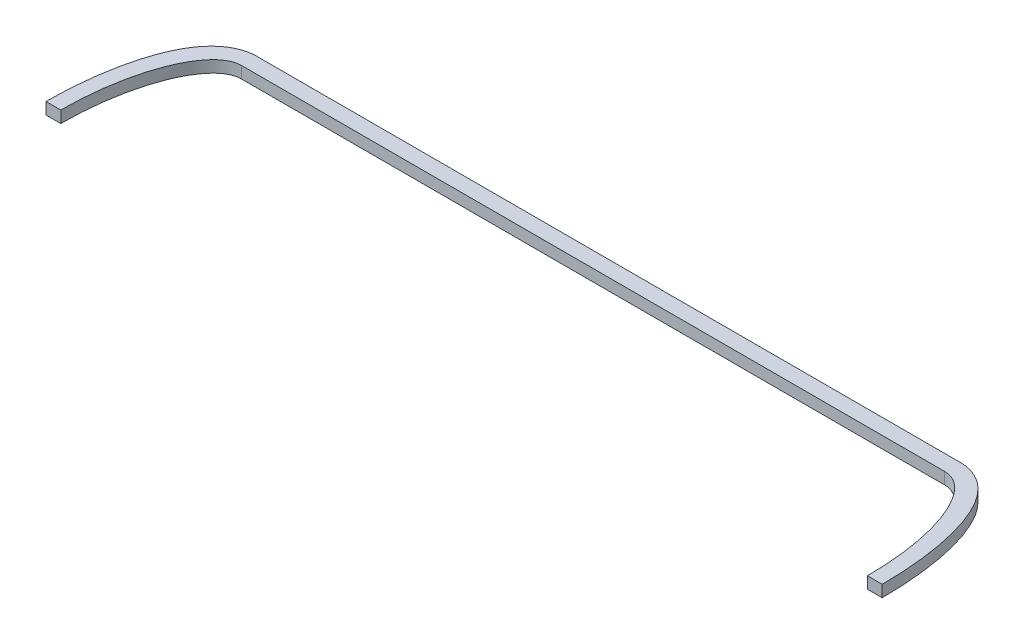
ISO-10303-21;
HEADER;
FILE_DESCRIPTION(('STEP AP214'),'2;1');
FILE_NAME('part.step','',(''),(''),'','','');
FILE_SCHEMA(('AUTOMOTIVE_DESIGN { 1 0 10303 214 1 1 1 1 }'));
ENDSEC;
DATA;
#1=APPLICATION_CONTEXT('core data for automotive mechanical design processes');
#2=APPLICATION_PROTOCOL_DEFINITION('international standard','automotive_design',2000,#1);
#3=PRODUCT_CONTEXT('',#1,'mechanical');
#4=PRODUCT('Part','Part','',(#3));
#5=PRODUCT_RELATED_PRODUCT_CATEGORY('part','',(#4));
#6=PRODUCT_DEFINITION_FORMATION('','',#4);
#7=PRODUCT_DEFINITION_CONTEXT('part definition',#1,'design');
#8=PRODUCT_DEFINITION('design','',#6,#7);
#9=PRODUCT_DEFINITION_SHAPE('','',#8);
#10=(LENGTH_UNIT() NAMED_UNIT(*) SI_UNIT(.MILLI.,.METRE.));
#11=(NAMED_UNIT(*) PLANE_ANGLE_UNIT() SI_UNIT($,.RADIAN.));
#12=(NAMED_UNIT(*) SI_UNIT($,.STERADIAN.) SOLID_ANGLE_UNIT());
#13=UNCERTAINTY_MEASURE_WITH_UNIT(LENGTH_MEASURE(1.E-05),#10,'distance_accuracy_value','');
#14=(GEOMETRIC_REPRESENTATION_CONTEXT(3) GLOBAL_UNCERTAINTY_ASSIGNED_CONTEXT((#13)) GLOBAL_UNIT_ASSIGNED_CONTEXT((#10,
#11,#12)) REPRESENTATION_CONTEXT('',''));
#15=CARTESIAN_POINT('',(0.,0.,0.));
#16=DIRECTION('',(0.,0.,1.));
#17=DIRECTION('',(1.,0.,0.));
#18=AXIS2_PLACEMENT_3D('',#15,#16,#17);
#19=CARTESIAN_POINT('',(-45.,1.5,0.));
#20=DIRECTION('',(0.,1.,0.));
#21=DIRECTION('',(0.,0.,1.));
#22=AXIS2_PLACEMENT_3D('',#19,#20,#21);
#23=PLANE('',#22);
#24=CARTESIAN_POINT('',(-45.,1.5,-18.5));
#25=CARTESIAN_POINT('',(-45.6096156581564,1.5,-18.5066374089498));
#26=CARTESIAN_POINT('',(-46.2099416409903,1.5,-18.3936002852506));
#27=CARTESIAN_POINT('',(-47.3435812208906,1.5,-17.9821458380661));
#28=CARTESIAN_POINT('',(-47.8770704995948,1.5,-17.6842273122789));
#29=CARTESIAN_POINT('',(-48.4396269479358,1.5,-17.2556535292892));
#30=CARTESIAN_POINT('',(-48.5227639789496,1.5,-17.1888888085388));
#31=CARTESIAN_POINT('',(-48.685847462233,1.5,-17.0515849808477));
#32=CARTESIAN_POINT('',(-48.765796171873,1.5,-16.9810486301748));
#33=CARTESIAN_POINT('',(-48.922407681129,1.5,-16.8365137465597));
#34=CARTESIAN_POINT('',(-48.9990718883342,1.5,-16.7625167257258));
#35=CARTESIAN_POINT('',(-49.1492182387745,1.5,-16.611340881595));
#36=CARTESIAN_POINT('',(-49.2226998043882,1.5,-16.5341614856455));
#37=CARTESIAN_POINT('',(-49.4387546634155,1.5,-16.2979518535553));
#38=CARTESIAN_POINT('',(-49.5765995759742,1.5,-16.1345655630092));
#39=CARTESIAN_POINT('',(-49.840335393651,1.5,-15.7984586866283));
#40=CARTESIAN_POINT('',(-49.9662234371425,1.5,-15.6257358817363));
#41=CARTESIAN_POINT('',(-50.2953533245893,1.5,-15.1432534607224));
#42=CARTESIAN_POINT('',(-50.4875641402264,1.5,-14.8259488519011));
#43=CARTESIAN_POINT('',(-50.8440153828896,1.5,-14.1760123937623));
#44=CARTESIAN_POINT('',(-51.0082335216971,1.5,-13.8433685963853));
#45=CARTESIAN_POINT('',(-51.3135655302771,1.5,-13.1668051026386));
#46=CARTESIAN_POINT('',(-51.4546241939358,1.5,-12.8228607432286));
#47=CARTESIAN_POINT('',(-51.7168511796132,1.5,-12.1276562604476));
#48=CARTESIAN_POINT('',(-51.8380247758003,1.5,-11.7763981048774));
#49=CARTESIAN_POINT('',(-52.0371091392322,1.5,-11.1510822241471));
#50=CARTESIAN_POINT('',(-52.1185189910126,1.5,-10.8781243194275));
#51=CARTESIAN_POINT('',(-52.2723745947749,1.5,-10.3296788511723));
#52=CARTESIAN_POINT('',(-52.3448197209187,1.5,-10.0541911124666));
#53=CARTESIAN_POINT('',(-52.4816300244978,1.5,-9.50097717422127));
#54=CARTESIAN_POINT('',(-52.5459882926059,1.5,-9.22324927339782));
#55=CARTESIAN_POINT('',(-52.6672268760889,1.5,-8.66616031108921));
#56=CARTESIAN_POINT('',(-52.7241067725101,1.5,-8.38679915902089));
#57=CARTESIAN_POINT('',(-52.884424264609,1.5,-7.5465208025232));
#58=CARTESIAN_POINT('',(-52.9774920369793,1.5,-6.98360514806118));
#59=CARTESIAN_POINT('',(-53.1395446736278,1.5,-5.85230694934456));
#60=CARTESIAN_POINT('',(-53.2084409127639,1.5,-5.28391197899897));
#61=CARTESIAN_POINT('',(-53.3237932513533,1.5,-4.14520864754049));
#62=CARTESIAN_POINT('',(-53.3702628437516,1.5,-3.57490164531739));
#63=CARTESIAN_POINT('',(-53.442148840114,1.5,-2.43309640770703));
#64=CARTESIAN_POINT('',(-53.4675694019916,1.5,-1.86159842994977));
#65=CARTESIAN_POINT('',(-53.5009683998547,1.5,-0.609684298130026));
#66=CARTESIAN_POINT('',(-53.5047283607287,1.5,0.0708478886414741));
#67=CARTESIAN_POINT('',(-53.4836287292929,1.5,1.43167753007978));
#68=CARTESIAN_POINT('',(-53.4587598400127,1.5,2.11197483669053));
#69=CARTESIAN_POINT('',(-53.3794111382958,1.5,3.47143283514415));
#70=CARTESIAN_POINT('',(-53.3249082490813,1.5,4.15059222687739));
#71=CARTESIAN_POINT('',(-53.2194569977145,1.5,5.16478613616034));
#72=CARTESIAN_POINT('',(-53.1805080441843,1.5,5.50109780442271));
#73=CARTESIAN_POINT('',(-53.0942948142808,1.5,6.17264874092315));
#74=CARTESIAN_POINT('',(-53.0470309096592,1.5,6.50788805642291));
#75=CARTESIAN_POINT('',(-52.9436781678647,1.5,7.1768172726053));
#76=CARTESIAN_POINT('',(-52.8875942392541,1.5,7.5105079294426));
#77=CARTESIAN_POINT('',(-52.7658924228384,1.5,8.17613207126109));
#78=CARTESIAN_POINT('',(-52.7002751739972,1.5,8.50806567246355));
#79=CARTESIAN_POINT('',(-52.5586996185673,1.5,9.16935204885695));
#80=CARTESIAN_POINT('',(-52.4827526525859,1.5,9.49870724116468));
#81=CARTESIAN_POINT('',(-52.3193543092578,1.5,10.1545287964678));
#82=CARTESIAN_POINT('',(-52.2319044190893,1.5,10.4809955270903));
#83=CARTESIAN_POINT('',(-52.0629200847029,1.5,11.0650127234532));
#84=CARTESIAN_POINT('',(-51.9837235558957,1.5,11.3232388635002));
#85=CARTESIAN_POINT('',(-51.8161466356376,1.5,11.8367006234023));
#86=CARTESIAN_POINT('',(-51.7277665604736,1.5,12.0919363459124));
#87=CARTESIAN_POINT('',(-51.5405566144076,1.5,12.5990524734968));
#88=CARTESIAN_POINT('',(-51.4417095123859,1.5,12.8509265524044));
#89=CARTESIAN_POINT('',(-51.2323310109716,1.5,13.3498237593502));
#90=CARTESIAN_POINT('',(-51.1217987107445,1.5,13.596846511647));
#91=CARTESIAN_POINT('',(-50.8862687387097,1.5,14.0870114021275));
#92=CARTESIAN_POINT('',(-50.7611367221042,1.5,14.3300894949259));
#93=CARTESIAN_POINT('',(-50.4954282987293,1.5,14.8076773362094));
#94=CARTESIAN_POINT('',(-50.3548537847931,1.5,15.0421881301289));
#95=CARTESIAN_POINT('',(-50.0566068967863,1.5,15.4992091911132));
#96=CARTESIAN_POINT('',(-49.8989874069132,1.5,15.7217535412171));
#97=CARTESIAN_POINT('',(-49.648020663604,1.5,16.0443338269566));
#98=CARTESIAN_POINT('',(-49.5619233376631,1.5,16.15000805588));
#99=CARTESIAN_POINT('',(-49.3846976014652,1.5,16.357076701907));
#100=CARTESIAN_POINT('',(-49.2935651117615,1.5,16.4584675277176));
#101=CARTESIAN_POINT('',(-48.7298542799801,1.5,17.0531779034087));
#102=CARTESIAN_POINT('',(-48.1908322058736,1.5,17.4904881980869));
#103=CARTESIAN_POINT('',(-46.9832252889388,1.5,18.1526719618782));
#104=CARTESIAN_POINT('',(-46.3138015984273,1.5,18.3761114394651));
#105=CARTESIAN_POINT('',(-45.4213658354158,1.5,18.4875398137615));
#106=CARTESIAN_POINT('',(-45.2105955804638,1.5,18.5006955175652));
#107=CARTESIAN_POINT('',(-45.,1.5,18.5));
#108=B_SPLINE_CURVE_WITH_KNOTS('',3,(#24,#25,#26,#27,#28,#29,#30,#31,#32,#33,#34,#35,#36,#37,
#38,#39,#40,#41,#42,#43,#44,#45,#46,#47,#48,#49,#50,#51,#52,#53,#54,#55,#56,#57,#58,#59,#60,#61,
#62,#63,#64,#65,#66,#67,#68,#69,#70,#71,#72,#73,#74,#75,#76,#77,#78,#79,#80,#81,#82,#83,#84,#85,
#86,#87,#88,#89,#90,#91,#92,#93,#94,#95,#96,#97,#98,#99,#100,#101,#102,#103,#104,#105,#106,
#107),.UNSPECIFIED.,.F.,.F.,(4,2,2,2,2,2,2,2,2,2,2,2,2,2,2,2,2,2,2,2,2,2,2,2,2,2,2,2,2,2,2,2,2,
2,2,2,2,2,2,2,2,4),(0.,1.80476779287426,3.60468748491556,3.92461476055143,4.24431134975102,
4.56386953222983,4.88348547073316,5.52410121214661,6.16486988724087,7.27587795148266,
8.38776652759027,9.50226823682613,10.6164738644143,11.4708370226783,12.3252597914446,
13.1804076768411,14.0356034489801,15.7466007076309,17.4638073549769,19.1799795565502,
20.8958126736763,22.9368173015177,24.9784849148879,27.0217447105739,28.0373399034024,
29.0528897016773,30.0678763083624,31.0827949176436,32.0966081471005,33.1102904323249,
33.9204356787409,34.7305530325171,35.5420253919907,36.3535603551226,37.1732599848995,
37.992859253497,38.8099848592747,39.2187125204248,39.6277763287475,41.6745295329125,
43.7349119107048,44.3669572296452),.UNSPECIFIED.);
#109=CARTESIAN_POINT('',(-45.,1.5,-18.5));
#110=VERTEX_POINT('',#109);
#111=CARTESIAN_POINT('',(-53.5000000000054,1.5,0.));
#112=VERTEX_POINT('',#111);
#113=EDGE_CURVE('E127',#110,#112,#108,.T.);
#114=ORIENTED_EDGE('',*,*,#113,.T.);
#115=DIRECTION('',(-1.,0.,0.));
#116=VECTOR('',#115,1.);
#117=CARTESIAN_POINT('',(-57.7028271625153,1.5,0.));
#118=LINE('',#117,#116);
#119=CARTESIAN_POINT('',(-51.6111894035447,1.5,0.));
#120=VERTEX_POINT('',#119);
#121=EDGE_CURVE('E109',#120,#112,#118,.T.);
#122=ORIENTED_EDGE('',*,*,#121,.F.);
#123=CARTESIAN_POINT('',(-45.,1.5,0.));
#124=DIRECTION('',(0.,1.,0.));
#125=DIRECTION('',(0.,0.,1.));
#126=AXIS2_PLACEMENT_3D('',#123,#124,#125);
#127=ELLIPSE('',#126,16.5,6.6111894035447);
#128=CARTESIAN_POINT('',(-45.,1.5,-16.5));
#129=VERTEX_POINT('',#128);
#130=EDGE_CURVE('E195',#129,#120,#127,.T.);
#131=ORIENTED_EDGE('',*,*,#130,.F.);
#132=DIRECTION('',(-1.,0.,0.));
#133=VECTOR('',#132,1.);
#134=CARTESIAN_POINT('',(-45.,1.5,-16.5));
#135=LINE('',#134,#133);
#136=CARTESIAN_POINT('',(45.,1.5,-16.5));
#137=VERTEX_POINT('',#136);
#138=EDGE_CURVE('E291',#137,#129,#135,.T.);
#139=ORIENTED_EDGE('',*,*,#138,.F.);
#140=CARTESIAN_POINT('',(45.,1.5,0.));
#141=DIRECTION('',(0.,1.,0.));
#142=DIRECTION('',(0.,0.,1.));
#143=AXIS2_PLACEMENT_3D('',#140,#141,#142);
#144=ELLIPSE('',#143,16.5,6.6111894035447);
#145=CARTESIAN_POINT('',(51.6111894035447,1.5,0.));
#146=VERTEX_POINT('',#145);
#147=EDGE_CURVE('E198',#146,#137,#144,.T.);
#148=ORIENTED_EDGE('',*,*,#147,.F.);
#149=CARTESIAN_POINT('',(53.5000000000054,1.5,0.));
#150=VERTEX_POINT('',#149);
#151=EDGE_CURVE('E63',#150,#146,#118,.T.);
#152=ORIENTED_EDGE('',*,*,#151,.F.);
#153=CARTESIAN_POINT('',(45.,1.5,18.5));
#154=CARTESIAN_POINT('',(45.6096156591008,1.5,18.5066374063438));
#155=CARTESIAN_POINT('',(46.2099416421988,1.5,18.3936002798255));
#156=CARTESIAN_POINT('',(47.34358122176,1.5,17.9821458271773));
#157=CARTESIAN_POINT('',(47.8770704998672,1.5,17.6842272987564));
#158=CARTESIAN_POINT('',(48.4396269477702,1.5,17.255653512771));
#159=CARTESIAN_POINT('',(48.5227639790637,1.5,17.1888887912781));
#160=CARTESIAN_POINT('',(48.685847462869,1.5,17.0515849620868));
#161=CARTESIAN_POINT('',(48.7657961727512,1.5,16.9810486106562));
#162=CARTESIAN_POINT('',(48.9224076824568,1.5,16.8365137255157));
#163=CARTESIAN_POINT('',(48.9990718898693,1.5,16.7625167039142));
#164=CARTESIAN_POINT('',(49.1492182406941,1.5,16.6113408582419));
#165=CARTESIAN_POINT('',(49.222699806485,1.5,16.5341614615186));
#166=CARTESIAN_POINT('',(49.4387546660115,1.5,16.2979518270924));
#167=CARTESIAN_POINT('',(49.5765995788517,1.5,16.1345655349801));
#168=CARTESIAN_POINT('',(49.8403353970145,1.5,15.7984586554767));
#169=CARTESIAN_POINT('',(49.9662234407104,1.5,15.6257358490284));
#170=CARTESIAN_POINT('',(50.2953533297854,1.5,15.1432534221168));
#171=CARTESIAN_POINT('',(50.4875641466146,1.5,14.8259488088505));
#172=CARTESIAN_POINT('',(50.8440153913132,1.5,14.176012341754));
#173=CARTESIAN_POINT('',(51.0082335309635,1.5,13.8433685398639));
#174=CARTESIAN_POINT('',(51.3135655409738,1.5,13.1668050370798));
#175=CARTESIAN_POINT('',(51.4546242052208,1.5,12.8228606731461));
#176=CARTESIAN_POINT('',(51.7168511918849,1.5,12.1276561813193));
#177=CARTESIAN_POINT('',(51.8380247884704,1.5,11.7763980212272));
#178=CARTESIAN_POINT('',(52.0371091526132,1.5,11.1510821320518));
#179=CARTESIAN_POINT('',(52.1185190047214,1.5,10.8781242234032));
#180=CARTESIAN_POINT('',(52.2723746090258,1.5,10.3296787472852));
#181=CARTESIAN_POINT('',(52.3448197353838,1.5,10.0541910046455));
#182=CARTESIAN_POINT('',(52.4816300392861,1.5,9.50097705852677));
#183=CARTESIAN_POINT('',(52.5459883075032,1.5,9.22324915376378));
#184=CARTESIAN_POINT('',(52.6672268911036,1.5,8.66616018357561));
#185=CARTESIAN_POINT('',(52.7241067875332,1.5,8.38679902756728));
#186=CARTESIAN_POINT('',(52.8844242795123,1.5,7.54652065924476));
#187=CARTESIAN_POINT('',(52.977492051608,1.5,6.9836049968989));
#188=CARTESIAN_POINT('',(53.1395446873409,1.5,5.85230678225125));
#189=CARTESIAN_POINT('',(53.2084409258282,1.5,5.28391180385762));
#190=CARTESIAN_POINT('',(53.323793262703,1.5,4.14520845633329));
#191=CARTESIAN_POINT('',(53.370262854036,1.5,3.57490144609237));
#192=CARTESIAN_POINT('',(53.4421488478175,1.5,2.43309619249656));
#193=CARTESIAN_POINT('',(53.46756940818,1.5,1.8615982067717));
#194=CARTESIAN_POINT('',(53.5009684021547,1.5,0.609684058427691));
#195=CARTESIAN_POINT('',(53.5047283605879,1.5,-0.0708481368879943));
#196=CARTESIAN_POINT('',(53.4836287235013,1.5,-1.43167779530895));
#197=CARTESIAN_POINT('',(53.4587598310104,1.5,-2.11197511035811));
#198=CARTESIAN_POINT('',(53.3794111219,1.5,-3.47143312557808));
#199=CARTESIAN_POINT('',(53.3249082284989,1.5,-4.15059252563893));
#200=CARTESIAN_POINT('',(53.2194569699261,1.5,-5.16478644698159));
#201=CARTESIAN_POINT('',(53.180508013861,1.5,-5.50109811909784));
#202=CARTESIAN_POINT('',(53.0942947785264,1.5,-6.17264906320398));
#203=CARTESIAN_POINT('',(53.0470308710087,1.5,-6.50788838245557));
#204=CARTESIAN_POINT('',(52.9436781230008,1.5,-7.17681760598305));
#205=CARTESIAN_POINT('',(52.8875941910739,1.5,-7.51050826641379));
#206=CARTESIAN_POINT('',(52.7658923675171,1.5,-8.17613241524087));
#207=CARTESIAN_POINT('',(52.7002751148514,1.5,-8.50806601985851));
#208=CARTESIAN_POINT('',(52.558699551169,1.5,-9.16935240279199));
#209=CARTESIAN_POINT('',(52.482752580762,1.5,-9.4987075982252));
#210=CARTESIAN_POINT('',(52.3193542278287,1.5,-10.1545291594459));
#211=CARTESIAN_POINT('',(52.2319043324809,1.5,-10.4809958928605));
#212=CARTESIAN_POINT('',(52.0629199911511,1.5,-11.0650130826834));
#213=CARTESIAN_POINT('',(51.9837234611051,1.5,-11.3232392135857));
#214=CARTESIAN_POINT('',(51.8161465384735,1.5,-11.8367009550856));
#215=CARTESIAN_POINT('',(51.7277664621746,1.5,-12.0919366683383));
#216=CARTESIAN_POINT('',(51.5405565139515,1.5,-12.5990527772428));
#217=CARTESIAN_POINT('',(51.441709410908,1.5,-12.8509268467278));
#218=CARTESIAN_POINT('',(51.2323309075842,1.5,-13.3498240346536));
#219=CARTESIAN_POINT('',(51.1217986064694,1.5,-13.596846777353));
#220=CARTESIAN_POINT('',(50.8862686327926,1.5,-14.0870116484185));
#221=CARTESIAN_POINT('',(50.7611366154299,1.5,-14.330089731395));
#222=CARTESIAN_POINT('',(50.4954281908133,1.5,-14.8076775527868));
#223=CARTESIAN_POINT('',(50.354853676393,1.5,-15.0421883366367));
#224=CARTESIAN_POINT('',(50.0566067878552,1.5,-15.499209377267));
#225=CARTESIAN_POINT('',(49.898987297934,1.5,-15.7217537170872));
#226=CARTESIAN_POINT('',(49.6480205550695,1.5,-16.0443339872735));
#227=CARTESIAN_POINT('',(49.5619232293622,1.5,-16.1500082109909));
#228=CARTESIAN_POINT('',(49.3846974938462,1.5,-16.3570768465896));
#229=CARTESIAN_POINT('',(49.2935650045911,1.5,-16.4584676671778));
#230=CARTESIAN_POINT('',(48.7298541676297,1.5,-17.0531780205521));
#231=CARTESIAN_POINT('',(48.1908320883439,1.5,-17.4904882957667));
#232=CARTESIAN_POINT('',(46.983225168548,1.5,-18.1526720185883));
#233=CARTESIAN_POINT('',(46.3138014804544,1.5,-18.3761114747447));
#234=CARTESIAN_POINT('',(45.4213657529837,1.5,-18.4875398209438));
#235=CARTESIAN_POINT('',(45.210595527696,1.5,-18.5006955191564));
#236=CARTESIAN_POINT('',(44.9999999770718,1.5,-18.5));
#237=B_SPLINE_CURVE_WITH_KNOTS('',3,(#153,#154,#155,#156,#157,#158,#159,#160,#161,#162,#163,
#164,#165,#166,#167,#168,#169,#170,#171,#172,#173,#174,#175,#176,#177,#178,#179,#180,#181,#182,
#183,#184,#185,#186,#187,#188,#189,#190,#191,#192,#193,#194,#195,#196,#197,#198,#199,#200,#201,
#202,#203,#204,#205,#206,#207,#208,#209,#210,#211,#212,#213,#214,#215,#216,#217,#218,#219,#220,
#221,#222,#223,#224,#225,#226,#227,#228,#229,#230,#231,#232,#233,#234,#235,#236),.UNSPECIFIED.,
.F.,.F.,(4,2,2,2,2,2,2,2,2,2,2,2,2,2,2,2,2,2,2,2,2,2,2,2,2,2,2,2,2,2,2,2,2,2,2,2,2,2,2,2,2,4),
(0.,1.8047677953285,3.60468748970472,3.92461476739085,4.24431135863775,4.56386954316314,
4.88348548371381,5.52410122926144,6.16486990849037,7.27587798596538,8.38776657532629,
9.5022682977838,10.616473938584,11.4708371084228,12.3252598887647,13.1804077857472,
14.0356035694726,15.7466008513137,17.4638075223846,19.1799797476617,20.8958128884539,
22.9368175418645,24.9784851808581,27.0217450024038,28.0373402075858,29.0528900182097,
30.0678766371635,31.0827952587048,32.0966085002611,33.1102907975619,33.920436018838,
34.7305533474806,35.5420256817546,36.3535606196855,37.173260224294,37.9928594677189,
38.8099850484011,39.2187126970048,39.6277764927689,41.6745296716446,43.7349120231502,
44.3669572528087),.UNSPECIFIED.);
#238=CARTESIAN_POINT('',(44.9999999770718,1.5,-18.5));
#239=VERTEX_POINT('',#238);
#240=EDGE_CURVE('E117',#150,#239,#237,.T.);
#241=ORIENTED_EDGE('',*,*,#240,.T.);
#242=DIRECTION('',(-1.,0.,0.));
#243=VECTOR('',#242,1.);
#244=CARTESIAN_POINT('',(-45.,1.5,-18.5));
#245=LINE('',#244,#243);
#246=EDGE_CURVE('E174',#239,#110,#245,.T.);
#247=ORIENTED_EDGE('',*,*,#246,.T.);
#248=EDGE_LOOP('',(#114,#122,#131,#139,#148,#152,#241,#247));
#249=FACE_BOUND('',#248,.T.);
#250=ADVANCED_FACE('F40',(#249),#23,.T.);
#251=CARTESIAN_POINT('',(-45.,0.,0.));
#252=DIRECTION('',(0.,1.,0.));
#253=DIRECTION('',(0.,0.,1.));
#254=AXIS2_PLACEMENT_3D('',#251,#252,#253);
#255=PLANE('',#254);
#256=DIRECTION('',(-1.,0.,0.));
#257=VECTOR('',#256,1.);
#258=CARTESIAN_POINT('',(-57.7028271625153,0.,0.));
#259=LINE('',#258,#257);
#260=CARTESIAN_POINT('',(-51.6111894035447,0.,0.));
#261=VERTEX_POINT('',#260);
#262=CARTESIAN_POINT('',(-53.5000000000054,0.,0.));
#263=VERTEX_POINT('',#262);
#264=EDGE_CURVE('E55',#261,#263,#259,.T.);
#265=ORIENTED_EDGE('',*,*,#264,.T.);
#266=CARTESIAN_POINT('',(-45.,0.,-18.5));
#267=CARTESIAN_POINT('',(-45.6096156581564,0.,-18.5066374089498));
#268=CARTESIAN_POINT('',(-46.2099416409903,0.,-18.3936002852506));
#269=CARTESIAN_POINT('',(-47.3435812208906,0.,-17.9821458380661));
#270=CARTESIAN_POINT('',(-47.8770704995948,0.,-17.6842273122789));
#271=CARTESIAN_POINT('',(-48.4396269479358,0.,-17.2556535292892));
#272=CARTESIAN_POINT('',(-48.5227639789496,0.,-17.1888888085388));
#273=CARTESIAN_POINT('',(-48.685847462233,0.,-17.0515849808477));
#274=CARTESIAN_POINT('',(-48.765796171873,0.,-16.9810486301748));
#275=CARTESIAN_POINT('',(-48.922407681129,0.,-16.8365137465597));
#276=CARTESIAN_POINT('',(-48.9990718883342,0.,-16.7625167257258));
#277=CARTESIAN_POINT('',(-49.1492182387745,0.,-16.611340881595));
#278=CARTESIAN_POINT('',(-49.2226998043882,0.,-16.5341614856455));
#279=CARTESIAN_POINT('',(-49.4387546634155,0.,-16.2979518535553));
#280=CARTESIAN_POINT('',(-49.5765995759742,0.,-16.1345655630092));
#281=CARTESIAN_POINT('',(-49.840335393651,0.,-15.7984586866283));
#282=CARTESIAN_POINT('',(-49.9662234371425,0.,-15.6257358817363));
#283=CARTESIAN_POINT('',(-50.2953533245893,0.,-15.1432534607224));
#284=CARTESIAN_POINT('',(-50.4875641402264,0.,-14.8259488519011));
#285=CARTESIAN_POINT('',(-50.8440153828896,0.,-14.1760123937623));
#286=CARTESIAN_POINT('',(-51.0082335216971,0.,-13.8433685963853));
#287=CARTESIAN_POINT('',(-51.3135655302771,0.,-13.1668051026386));
#288=CARTESIAN_POINT('',(-51.4546241939358,0.,-12.8228607432286));
#289=CARTESIAN_POINT('',(-51.7168511796132,0.,-12.1276562604476));
#290=CARTESIAN_POINT('',(-51.8380247758003,0.,-11.7763981048774));
#291=CARTESIAN_POINT('',(-52.0371091392322,0.,-11.1510822241471));
#292=CARTESIAN_POINT('',(-52.1185189910126,0.,-10.8781243194275));
#293=CARTESIAN_POINT('',(-52.2723745947749,0.,-10.3296788511723));
#294=CARTESIAN_POINT('',(-52.3448197209187,0.,-10.0541911124666));
#295=CARTESIAN_POINT('',(-52.4816300244978,0.,-9.50097717422127));
#296=CARTESIAN_POINT('',(-52.5459882926059,0.,-9.22324927339782));
#297=CARTESIAN_POINT('',(-52.6672268760889,0.,-8.66616031108921));
#298=CARTESIAN_POINT('',(-52.7241067725101,0.,-8.38679915902089));
#299=CARTESIAN_POINT('',(-52.884424264609,0.,-7.5465208025232));
#300=CARTESIAN_POINT('',(-52.9774920369793,0.,-6.98360514806118));
#301=CARTESIAN_POINT('',(-53.1395446736278,0.,-5.85230694934456));
#302=CARTESIAN_POINT('',(-53.2084409127639,0.,-5.28391197899897));
#303=CARTESIAN_POINT('',(-53.3237932513533,0.,-4.14520864754049));
#304=CARTESIAN_POINT('',(-53.3702628437516,0.,-3.57490164531739));
#305=CARTESIAN_POINT('',(-53.442148840114,0.,-2.43309640770703));
#306=CARTESIAN_POINT('',(-53.4675694019916,0.,-1.86159842994977));
#307=CARTESIAN_POINT('',(-53.5009683998547,0.,-0.609684298130026));
#308=CARTESIAN_POINT('',(-53.5047283607287,0.,0.0708478886414741));
#309=CARTESIAN_POINT('',(-53.4836287292929,0.,1.43167753007978));
#310=CARTESIAN_POINT('',(-53.4587598400127,0.,2.11197483669053));
#311=CARTESIAN_POINT('',(-53.3794111382958,0.,3.47143283514415));
#312=CARTESIAN_POINT('',(-53.3249082490813,0.,4.15059222687739));
#313=CARTESIAN_POINT('',(-53.2194569977145,0.,5.16478613616034));
#314=CARTESIAN_POINT('',(-53.1805080441843,0.,5.50109780442271));
#315=CARTESIAN_POINT('',(-53.0942948142808,0.,6.17264874092315));
#316=CARTESIAN_POINT('',(-53.0470309096592,0.,6.50788805642291));
#317=CARTESIAN_POINT('',(-52.9436781678647,0.,7.1768172726053));
#318=CARTESIAN_POINT('',(-52.8875942392541,0.,7.5105079294426));
#319=CARTESIAN_POINT('',(-52.7658924228384,0.,8.17613207126109));
#320=CARTESIAN_POINT('',(-52.7002751739972,0.,8.50806567246355));
#321=CARTESIAN_POINT('',(-52.5586996185673,0.,9.16935204885695));
#322=CARTESIAN_POINT('',(-52.4827526525859,0.,9.49870724116468));
#323=CARTESIAN_POINT('',(-52.3193543092578,0.,10.1545287964678));
#324=CARTESIAN_POINT('',(-52.2319044190893,0.,10.4809955270903));
#325=CARTESIAN_POINT('',(-52.0629200847029,0.,11.0650127234532));
#326=CARTESIAN_POINT('',(-51.9837235558957,0.,11.3232388635002));
#327=CARTESIAN_POINT('',(-51.8161466356376,0.,11.8367006234023));
#328=CARTESIAN_POINT('',(-51.7277665604736,0.,12.0919363459124));
#329=CARTESIAN_POINT('',(-51.5405566144076,0.,12.5990524734968));
#330=CARTESIAN_POINT('',(-51.4417095123859,0.,12.8509265524044));
#331=CARTESIAN_POINT('',(-51.2323310109716,0.,13.3498237593502));
#332=CARTESIAN_POINT('',(-51.1217987107445,0.,13.596846511647));
#333=CARTESIAN_POINT('',(-50.8862687387097,0.,14.0870114021275));
#334=CARTESIAN_POINT('',(-50.7611367221042,0.,14.3300894949259));
#335=CARTESIAN_POINT('',(-50.4954282987293,0.,14.8076773362094));
#336=CARTESIAN_POINT('',(-50.3548537847931,0.,15.0421881301289));
#337=CARTESIAN_POINT('',(-50.0566068967863,0.,15.4992091911132));
#338=CARTESIAN_POINT('',(-49.8989874069132,0.,15.7217535412171));
#339=CARTESIAN_POINT('',(-49.648020663604,0.,16.0443338269566));
#340=CARTESIAN_POINT('',(-49.5619233376631,0.,16.15000805588));
#341=CARTESIAN_POINT('',(-49.3846976014652,0.,16.357076701907));
#342=CARTESIAN_POINT('',(-49.2935651117615,0.,16.4584675277176));
#343=CARTESIAN_POINT('',(-48.7298542799801,0.,17.0531779034087));
#344=CARTESIAN_POINT('',(-48.1908322058736,0.,17.4904881980869));
#345=CARTESIAN_POINT('',(-46.9832252889388,0.,18.1526719618782));
#346=CARTESIAN_POINT('',(-46.3138015984273,0.,18.3761114394651));
#347=CARTESIAN_POINT('',(-45.4213658354158,0.,18.4875398137615));
#348=CARTESIAN_POINT('',(-45.2105955804638,0.,18.5006955175652));
#349=CARTESIAN_POINT('',(-45.,0.,18.5));
#350=B_SPLINE_CURVE_WITH_KNOTS('',3,(#266,#267,#268,#269,#270,#271,#272,#273,#274,#275,#276,
#277,#278,#279,#280,#281,#282,#283,#284,#285,#286,#287,#288,#289,#290,#291,#292,#293,#294,#295,
#296,#297,#298,#299,#300,#301,#302,#303,#304,#305,#306,#307,#308,#309,#310,#311,#312,#313,#314,
#315,#316,#317,#318,#319,#320,#321,#322,#323,#324,#325,#326,#327,#328,#329,#330,#331,#332,#333,
#334,#335,#336,#337,#338,#339,#340,#341,#342,#343,#344,#345,#346,#347,#348,#349),.UNSPECIFIED.,
.F.,.F.,(4,2,2,2,2,2,2,2,2,2,2,2,2,2,2,2,2,2,2,2,2,2,2,2,2,2,2,2,2,2,2,2,2,2,2,2,2,2,2,2,2,4),
(0.,1.80476779287426,3.60468748491556,3.92461476055143,4.24431134975102,4.56386953222983,
4.88348547073316,5.52410121214661,6.16486988724087,7.27587795148266,8.38776652759027,
9.50226823682613,10.6164738644143,11.4708370226783,12.3252597914446,13.1804076768411,
14.0356034489801,15.7466007076309,17.4638073549769,19.1799795565502,20.8958126736763,
22.9368173015177,24.9784849148879,27.0217447105739,28.0373399034024,29.0528897016773,
30.0678763083624,31.0827949176436,32.0966081471005,33.1102904323249,33.9204356787409,
34.7305530325171,35.5420253919907,36.3535603551226,37.1732599848995,37.992859253497,
38.8099848592747,39.2187125204248,39.6277763287475,41.6745295329125,43.7349119107048,
44.3669572296452),.UNSPECIFIED.);
#351=CARTESIAN_POINT('',(-45.,0.,-18.5));
#352=VERTEX_POINT('',#351);
#353=EDGE_CURVE('E125',#352,#263,#350,.T.);
#354=ORIENTED_EDGE('',*,*,#353,.F.);
#355=DIRECTION('',(-1.,0.,0.));
#356=VECTOR('',#355,1.);
#357=CARTESIAN_POINT('',(-45.,0.,-18.5));
#358=LINE('',#357,#356);
#359=CARTESIAN_POINT('',(44.9999999770718,0.,-18.5));
#360=VERTEX_POINT('',#359);
#361=EDGE_CURVE('E124',#360,#352,#358,.T.);
#362=ORIENTED_EDGE('',*,*,#361,.F.);
#363=CARTESIAN_POINT('',(45.,0.,18.5));
#364=CARTESIAN_POINT('',(45.6096156591008,0.,18.5066374063438));
#365=CARTESIAN_POINT('',(46.2099416421988,0.,18.3936002798255));
#366=CARTESIAN_POINT('',(47.34358122176,0.,17.9821458271773));
#367=CARTESIAN_POINT('',(47.8770704998672,0.,17.6842272987564));
#368=CARTESIAN_POINT('',(48.4396269477702,0.,17.255653512771));
#369=CARTESIAN_POINT('',(48.5227639790637,0.,17.1888887912781));
#370=CARTESIAN_POINT('',(48.685847462869,0.,17.0515849620868));
#371=CARTESIAN_POINT('',(48.7657961727512,0.,16.9810486106562));
#372=CARTESIAN_POINT('',(48.9224076824568,0.,16.8365137255157));
#373=CARTESIAN_POINT('',(48.9990718898693,0.,16.7625167039142));
#374=CARTESIAN_POINT('',(49.1492182406941,0.,16.6113408582419));
#375=CARTESIAN_POINT('',(49.222699806485,0.,16.5341614615186));
#376=CARTESIAN_POINT('',(49.4387546660115,0.,16.2979518270924));
#377=CARTESIAN_POINT('',(49.5765995788517,0.,16.1345655349801));
#378=CARTESIAN_POINT('',(49.8403353970145,0.,15.7984586554767));
#379=CARTESIAN_POINT('',(49.9662234407104,0.,15.6257358490284));
#380=CARTESIAN_POINT('',(50.2953533297854,0.,15.1432534221168));
#381=CARTESIAN_POINT('',(50.4875641466146,0.,14.8259488088505));
#382=CARTESIAN_POINT('',(50.8440153913132,0.,14.176012341754));
#383=CARTESIAN_POINT('',(51.0082335309635,0.,13.8433685398639));
#384=CARTESIAN_POINT('',(51.3135655409738,0.,13.1668050370798));
#385=CARTESIAN_POINT('',(51.4546242052208,0.,12.8228606731461));
#386=CARTESIAN_POINT('',(51.7168511918849,0.,12.1276561813193));
#387=CARTESIAN_POINT('',(51.8380247884704,0.,11.7763980212272));
#388=CARTESIAN_POINT('',(52.0371091526132,0.,11.1510821320518));
#389=CARTESIAN_POINT('',(52.1185190047214,0.,10.8781242234032));
#390=CARTESIAN_POINT('',(52.2723746090258,0.,10.3296787472852));
#391=CARTESIAN_POINT('',(52.3448197353838,0.,10.0541910046455));
#392=CARTESIAN_POINT('',(52.4816300392861,0.,9.50097705852677));
#393=CARTESIAN_POINT('',(52.5459883075032,0.,9.22324915376378));
#394=CARTESIAN_POINT('',(52.6672268911036,0.,8.66616018357561));
#395=CARTESIAN_POINT('',(52.7241067875332,0.,8.38679902756728));
#396=CARTESIAN_POINT('',(52.8844242795123,0.,7.54652065924476));
#397=CARTESIAN_POINT('',(52.977492051608,0.,6.9836049968989));
#398=CARTESIAN_POINT('',(53.1395446873409,0.,5.85230678225125));
#399=CARTESIAN_POINT('',(53.2084409258282,0.,5.28391180385762));
#400=CARTESIAN_POINT('',(53.323793262703,0.,4.14520845633329));
#401=CARTESIAN_POINT('',(53.370262854036,0.,3.57490144609237));
#402=CARTESIAN_POINT('',(53.4421488478175,0.,2.43309619249656));
#403=CARTESIAN_POINT('',(53.46756940818,0.,1.8615982067717));
#404=CARTESIAN_POINT('',(53.5009684021547,0.,0.609684058427691));
#405=CARTESIAN_POINT('',(53.5047283605879,0.,-0.0708481368879943));
#406=CARTESIAN_POINT('',(53.4836287235013,0.,-1.43167779530895));
#407=CARTESIAN_POINT('',(53.4587598310104,0.,-2.11197511035811));
#408=CARTESIAN_POINT('',(53.3794111219,0.,-3.47143312557808));
#409=CARTESIAN_POINT('',(53.3249082284989,0.,-4.15059252563893));
#410=CARTESIAN_POINT('',(53.2194569699261,0.,-5.16478644698159));
#411=CARTESIAN_POINT('',(53.180508013861,0.,-5.50109811909784));
#412=CARTESIAN_POINT('',(53.0942947785264,0.,-6.17264906320398));
#413=CARTESIAN_POINT('',(53.0470308710087,0.,-6.50788838245557));
#414=CARTESIAN_POINT('',(52.9436781230008,0.,-7.17681760598305));
#415=CARTESIAN_POINT('',(52.8875941910739,0.,-7.51050826641379));
#416=CARTESIAN_POINT('',(52.7658923675171,0.,-8.17613241524087));
#417=CARTESIAN_POINT('',(52.7002751148514,0.,-8.50806601985851));
#418=CARTESIAN_POINT('',(52.558699551169,0.,-9.16935240279199));
#419=CARTESIAN_POINT('',(52.482752580762,0.,-9.4987075982252));
#420=CARTESIAN_POINT('',(52.3193542278287,0.,-10.1545291594459));
#421=CARTESIAN_POINT('',(52.2319043324809,0.,-10.4809958928605));
#422=CARTESIAN_POINT('',(52.0629199911511,0.,-11.0650130826834));
#423=CARTESIAN_POINT('',(51.9837234611051,0.,-11.3232392135857));
#424=CARTESIAN_POINT('',(51.8161465384735,0.,-11.8367009550856));
#425=CARTESIAN_POINT('',(51.7277664621746,0.,-12.0919366683383));
#426=CARTESIAN_POINT('',(51.5405565139515,0.,-12.5990527772428));
#427=CARTESIAN_POINT('',(51.441709410908,0.,-12.8509268467278));
#428=CARTESIAN_POINT('',(51.2323309075842,0.,-13.3498240346536));
#429=CARTESIAN_POINT('',(51.1217986064694,0.,-13.596846777353));
#430=CARTESIAN_POINT('',(50.8862686327926,0.,-14.0870116484185));
#431=CARTESIAN_POINT('',(50.7611366154299,0.,-14.330089731395));
#432=CARTESIAN_POINT('',(50.4954281908133,0.,-14.8076775527868));
#433=CARTESIAN_POINT('',(50.354853676393,0.,-15.0421883366367));
#434=CARTESIAN_POINT('',(50.0566067878552,0.,-15.499209377267));
#435=CARTESIAN_POINT('',(49.898987297934,0.,-15.7217537170872));
#436=CARTESIAN_POINT('',(49.6480205550695,0.,-16.0443339872735));
#437=CARTESIAN_POINT('',(49.5619232293622,0.,-16.1500082109909));
#438=CARTESIAN_POINT('',(49.3846974938462,0.,-16.3570768465896));
#439=CARTESIAN_POINT('',(49.2935650045911,0.,-16.4584676671778));
#440=CARTESIAN_POINT('',(48.7298541676297,0.,-17.0531780205521));
#441=CARTESIAN_POINT('',(48.1908320883439,0.,-17.4904882957667));
#442=CARTESIAN_POINT('',(46.983225168548,0.,-18.1526720185883));
#443=CARTESIAN_POINT('',(46.3138014804544,0.,-18.3761114747447));
#444=CARTESIAN_POINT('',(45.4213657529837,0.,-18.4875398209438));
#445=CARTESIAN_POINT('',(45.210595527696,0.,-18.5006955191564));
#446=CARTESIAN_POINT('',(44.9999999770718,0.,-18.5));
#447=B_SPLINE_CURVE_WITH_KNOTS('',3,(#363,#364,#365,#366,#367,#368,#369,#370,#371,#372,#373,
#374,#375,#376,#377,#378,#379,#380,#381,#382,#383,#384,#385,#386,#387,#388,#389,#390,#391,#392,
#393,#394,#395,#396,#397,#398,#399,#400,#401,#402,#403,#404,#405,#406,#407,#408,#409,#410,#411,
#412,#413,#414,#415,#416,#417,#418,#419,#420,#421,#422,#423,#424,#425,#426,#427,#428,#429,#430,
#431,#432,#433,#434,#435,#436,#437,#438,#439,#440,#441,#442,#443,#444,#445,#446),.UNSPECIFIED.,
.F.,.F.,(4,2,2,2,2,2,2,2,2,2,2,2,2,2,2,2,2,2,2,2,2,2,2,2,2,2,2,2,2,2,2,2,2,2,2,2,2,2,2,2,2,4),
(0.,1.8047677953285,3.60468748970472,3.92461476739085,4.24431135863775,4.56386954316314,
4.88348548371381,5.52410122926144,6.16486990849037,7.27587798596538,8.38776657532629,
9.5022682977838,10.616473938584,11.4708371084228,12.3252598887647,13.1804077857472,
14.0356035694726,15.7466008513137,17.4638075223846,19.1799797476617,20.8958128884539,
22.9368175418645,24.9784851808581,27.0217450024038,28.0373402075858,29.0528900182097,
30.0678766371635,31.0827952587048,32.0966085002611,33.1102907975619,33.920436018838,
34.7305533474806,35.5420256817546,36.3535606196855,37.173260224294,37.9928594677189,
38.8099850484011,39.2187126970048,39.6277764927689,41.6745296716446,43.7349120231502,
44.3669572528087),.UNSPECIFIED.);
#448=CARTESIAN_POINT('',(53.5000000000054,0.,0.));
#449=VERTEX_POINT('',#448);
#450=EDGE_CURVE('E115',#449,#360,#447,.T.);
#451=ORIENTED_EDGE('',*,*,#450,.F.);
#452=CARTESIAN_POINT('',(51.6111894035447,0.,0.));
#453=VERTEX_POINT('',#452);
#454=EDGE_CURVE('E102',#449,#453,#259,.T.);
#455=ORIENTED_EDGE('',*,*,#454,.T.);
#456=CARTESIAN_POINT('',(45.,0.,0.));
#457=DIRECTION('',(0.,1.,0.));
#458=DIRECTION('',(0.,0.,1.));
#459=AXIS2_PLACEMENT_3D('',#456,#457,#458);
#460=ELLIPSE('',#459,16.5,6.6111894035447);
#461=CARTESIAN_POINT('',(45.,0.,-16.5));
#462=VERTEX_POINT('',#461);
#463=EDGE_CURVE('E191',#453,#462,#460,.T.);
#464=ORIENTED_EDGE('',*,*,#463,.T.);
#465=DIRECTION('',(-1.,0.,0.));
#466=VECTOR('',#465,1.);
#467=CARTESIAN_POINT('',(-45.,0.,-16.5));
#468=LINE('',#467,#466);
#469=CARTESIAN_POINT('',(-45.,0.,-16.5));
#470=VERTEX_POINT('',#469);
#471=EDGE_CURVE('E199',#462,#470,#468,.T.);
#472=ORIENTED_EDGE('',*,*,#471,.T.);
#473=CARTESIAN_POINT('',(-45.,0.,0.));
#474=DIRECTION('',(0.,1.,0.));
#475=DIRECTION('',(0.,0.,1.));
#476=AXIS2_PLACEMENT_3D('',#473,#474,#475);
#477=ELLIPSE('',#476,16.5,6.6111894035447);
#478=EDGE_CURVE('E188',#470,#261,#477,.T.);
#479=ORIENTED_EDGE('',*,*,#478,.T.);
#480=EDGE_LOOP('',(#265,#354,#362,#451,#455,#464,#472,#479));
#481=FACE_BOUND('',#480,.T.);
#482=ADVANCED_FACE('F122',(#481),#255,.F.);
#483=CARTESIAN_POINT('',(-45.,1.5,0.));
#484=DIRECTION('',(0.,1.,0.));
#485=DIRECTION('',(8.18865345901068E-10,0.,1.));
#486=AXIS2_PLACEMENT_3D('',#483,#484,#485);
#487=ELLIPSE('',#486,15.,5.00000000000537);
#488=DIRECTION('',(0.,-1.,0.));
#489=VECTOR('',#488,1.);
#490=SURFACE_OF_LINEAR_EXTRUSION('',#487,#489);
#491=OFFSET_SURFACE('',#490,-3.5,.F.);
#492=DIRECTION('',(0.,-1.,0.));
#493=VECTOR('',#492,1.);
#494=CARTESIAN_POINT('',(-53.5000000000054,0.75,0.));
#495=LINE('',#494,#493);
#496=EDGE_CURVE('E118',#112,#263,#495,.T.);
#497=ORIENTED_EDGE('',*,*,#496,.F.);
#498=ORIENTED_EDGE('',*,*,#113,.F.);
#499=DIRECTION('',(0.,-1.,0.));
#500=VECTOR('',#499,1.);
#501=CARTESIAN_POINT('',(-44.9999999770718,1.5,-18.5));
#502=LINE('',#501,#500);
#503=EDGE_CURVE('E172',#110,#352,#502,.T.);
#504=ORIENTED_EDGE('',*,*,#503,.T.);
#505=ORIENTED_EDGE('',*,*,#353,.T.);
#506=EDGE_LOOP('',(#497,#498,#504,#505));
#507=FACE_BOUND('',#506,.T.);
#508=ADVANCED_FACE('F149',(#507),#491,.F.);
#509=CARTESIAN_POINT('',(45.,1.5,0.));
#510=DIRECTION('',(0.,1.,0.));
#511=DIRECTION('',(-8.18864883308141E-10,0.,1.));
#512=AXIS2_PLACEMENT_3D('',#509,#510,#511);
#513=ELLIPSE('',#512,15.,5.00000000000537);
#514=DIRECTION('',(0.,-1.,0.));
#515=VECTOR('',#514,1.);
#516=SURFACE_OF_LINEAR_EXTRUSION('',#513,#515);
#517=OFFSET_SURFACE('',#516,-3.5,.F.);
#518=DIRECTION('',(0.,-1.,0.));
#519=VECTOR('',#518,1.);
#520=CARTESIAN_POINT('',(53.5000000000054,0.75,0.));
#521=LINE('',#520,#519);
#522=EDGE_CURVE('E105',#449,#150,#521,.F.);
#523=ORIENTED_EDGE('',*,*,#522,.F.);
#524=ORIENTED_EDGE('',*,*,#450,.T.);
#525=DIRECTION('',(0.,1.,0.));
#526=VECTOR('',#525,1.);
#527=CARTESIAN_POINT('',(45.,1.5,-18.5));
#528=LINE('',#527,#526);
#529=EDGE_CURVE('E48',#239,#360,#528,.F.);
#530=ORIENTED_EDGE('',*,*,#529,.F.);
#531=ORIENTED_EDGE('',*,*,#240,.F.);
#532=EDGE_LOOP('',(#523,#524,#530,#531));
#533=FACE_BOUND('',#532,.T.);
#534=ADVANCED_FACE('F113',(#533),#517,.F.);
#535=DIRECTION('',(0.,-1.,0.));
#536=VECTOR('',#535,1.);
#537=SURFACE_OF_LINEAR_EXTRUSION('',#127,#536);
#538=ORIENTED_EDGE('',*,*,#130,.T.);
#539=DIRECTION('',(0.,-1.,0.));
#540=VECTOR('',#539,1.);
#541=CARTESIAN_POINT('',(-51.6111894035447,1.5,0.));
#542=LINE('',#541,#540);
#543=EDGE_CURVE('E119',#120,#261,#542,.T.);
#544=ORIENTED_EDGE('',*,*,#543,.T.);
#545=ORIENTED_EDGE('',*,*,#478,.F.);
#546=DIRECTION('',(0.,-1.,0.));
#547=VECTOR('',#546,1.);
#548=CARTESIAN_POINT('',(-45.,1.5,-16.5));
#549=LINE('',#548,#547);
#550=EDGE_CURVE('E288',#129,#470,#549,.T.);
#551=ORIENTED_EDGE('',*,*,#550,.F.);
#552=EDGE_LOOP('',(#538,#544,#545,#551));
#553=FACE_BOUND('',#552,.T.);
#554=ADVANCED_FACE('F202',(#553),#537,.T.);
#555=DIRECTION('',(0.,-1.,0.));
#556=VECTOR('',#555,1.);
#557=SURFACE_OF_LINEAR_EXTRUSION('',#144,#556);
#558=ORIENTED_EDGE('',*,*,#463,.F.);
#559=DIRECTION('',(0.,-1.,0.));
#560=VECTOR('',#559,1.);
#561=CARTESIAN_POINT('',(51.6111894035447,1.5,0.));
#562=LINE('',#561,#560);
#563=EDGE_CURVE('E11',#453,#146,#562,.F.);
#564=ORIENTED_EDGE('',*,*,#563,.T.);
#565=ORIENTED_EDGE('',*,*,#147,.T.);
#566=DIRECTION('',(0.,-1.,0.));
#567=VECTOR('',#566,1.);
#568=CARTESIAN_POINT('',(45.,1.5,-16.5));
#569=LINE('',#568,#567);
#570=EDGE_CURVE('E130',#137,#462,#569,.T.);
#571=ORIENTED_EDGE('',*,*,#570,.T.);
#572=EDGE_LOOP('',(#558,#564,#565,#571));
#573=FACE_BOUND('',#572,.T.);
#574=ADVANCED_FACE('F205',(#573),#557,.T.);
#575=CARTESIAN_POINT('',(-45.,1.5,-18.5));
#576=DIRECTION('',(0.,0.,1.));
#577=DIRECTION('',(1.,0.,0.));
#578=AXIS2_PLACEMENT_3D('',#575,#576,#577);
#579=PLANE('',#578);
#580=ORIENTED_EDGE('',*,*,#361,.T.);
#581=ORIENTED_EDGE('',*,*,#503,.F.);
#582=ORIENTED_EDGE('',*,*,#246,.F.);
#583=ORIENTED_EDGE('',*,*,#529,.T.);
#584=EDGE_LOOP('',(#580,#581,#582,#583));
#585=FACE_BOUND('',#584,.T.);
#586=ADVANCED_FACE('F42',(#585),#579,.F.);
#587=CARTESIAN_POINT('',(-45.,1.5,-16.5));
#588=DIRECTION('',(0.,0.,1.));
#589=DIRECTION('',(1.,0.,0.));
#590=AXIS2_PLACEMENT_3D('',#587,#588,#589);
#591=PLANE('',#590);
#592=ORIENTED_EDGE('',*,*,#471,.F.);
#593=ORIENTED_EDGE('',*,*,#570,.F.);
#594=ORIENTED_EDGE('',*,*,#138,.T.);
#595=ORIENTED_EDGE('',*,*,#550,.T.);
#596=EDGE_LOOP('',(#592,#593,#594,#595));
#597=FACE_BOUND('',#596,.T.);
#598=ADVANCED_FACE('F210',(#597),#591,.T.);
#599=CARTESIAN_POINT('',(-57.7028271625153,1.5,0.));
#600=DIRECTION('',(0.,0.,1.));
#601=DIRECTION('',(1.,0.,0.));
#602=AXIS2_PLACEMENT_3D('',#599,#600,#601);
#603=PLANE('',#602);
#604=ORIENTED_EDGE('',*,*,#522,.T.);
#605=ORIENTED_EDGE('',*,*,#151,.T.);
#606=ORIENTED_EDGE('',*,*,#563,.F.);
#607=ORIENTED_EDGE('',*,*,#454,.F.);
#608=EDGE_LOOP('',(#604,#605,#606,#607));
#609=FACE_BOUND('',#608,.T.);
#610=ADVANCED_FACE('F104',(#609),#603,.T.);
#611=ORIENTED_EDGE('',*,*,#496,.T.);
#612=ORIENTED_EDGE('',*,*,#264,.F.);
#613=ORIENTED_EDGE('',*,*,#543,.F.);
#614=ORIENTED_EDGE('',*,*,#121,.T.);
#615=EDGE_LOOP('',(#611,#612,#613,#614));
#616=FACE_BOUND('',#615,.T.);
#617=ADVANCED_FACE('F214',(#616),#603,.T.);
#618=CLOSED_SHELL('',(#250,#482,#508,#534,#554,#574,#586,#598,#610,#617));
#619=MANIFOLD_SOLID_BREP('B2',#618);
#620=ADVANCED_BREP_SHAPE_REPRESENTATION('',(#18,#619),#14);
#621=SHAPE_DEFINITION_REPRESENTATION(#9,#620);
ENDSEC;
END-ISO-10303-21;
